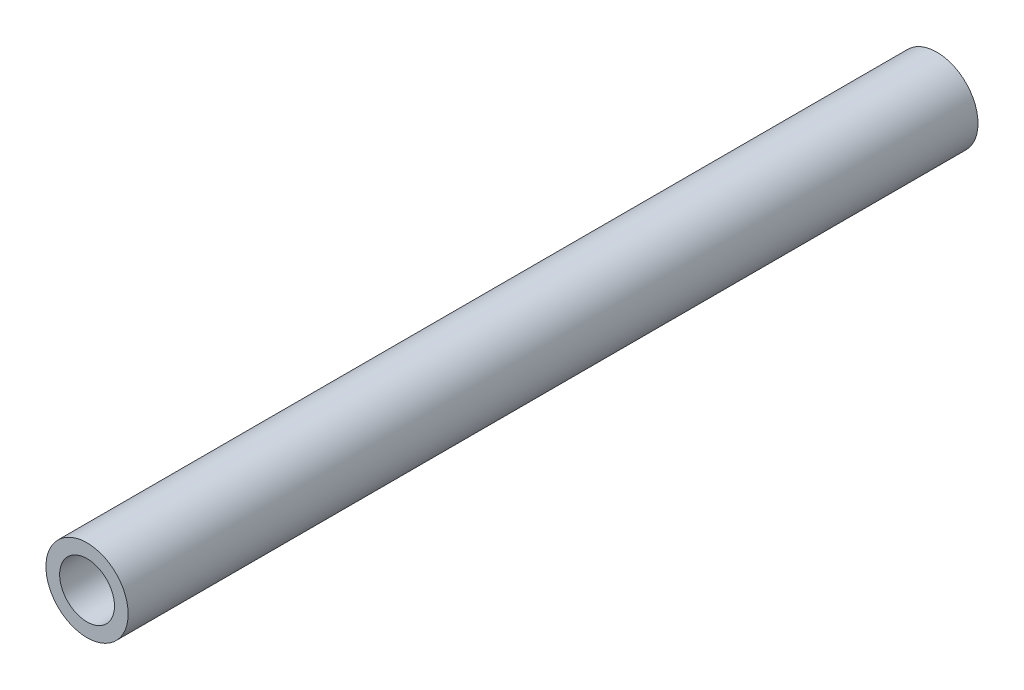
ISO-10303-21;
HEADER;
FILE_DESCRIPTION(('STEP AP214'),'2;1');
FILE_NAME('part.step','',(''),(''),'','','');
FILE_SCHEMA(('AUTOMOTIVE_DESIGN { 1 0 10303 214 1 1 1 1 }'));
ENDSEC;
DATA;
#1=APPLICATION_CONTEXT('core data for automotive mechanical design processes');
#2=APPLICATION_PROTOCOL_DEFINITION('international standard','automotive_design',2000,#1);
#3=PRODUCT_CONTEXT('',#1,'mechanical');
#4=PRODUCT('Part','Part','',(#3));
#5=PRODUCT_RELATED_PRODUCT_CATEGORY('part','',(#4));
#6=PRODUCT_DEFINITION_FORMATION('','',#4);
#7=PRODUCT_DEFINITION_CONTEXT('part definition',#1,'design');
#8=PRODUCT_DEFINITION('design','',#6,#7);
#9=PRODUCT_DEFINITION_SHAPE('','',#8);
#10=(LENGTH_UNIT() NAMED_UNIT(*) SI_UNIT(.MILLI.,.METRE.));
#11=(NAMED_UNIT(*) PLANE_ANGLE_UNIT() SI_UNIT($,.RADIAN.));
#12=(NAMED_UNIT(*) SI_UNIT($,.STERADIAN.) SOLID_ANGLE_UNIT());
#13=UNCERTAINTY_MEASURE_WITH_UNIT(LENGTH_MEASURE(1.E-05),#10,'distance_accuracy_value','');
#14=(GEOMETRIC_REPRESENTATION_CONTEXT(3) GLOBAL_UNCERTAINTY_ASSIGNED_CONTEXT((#13)) GLOBAL_UNIT_ASSIGNED_CONTEXT((#10,
#11,#12)) REPRESENTATION_CONTEXT('',''));
#15=CARTESIAN_POINT('',(0.,0.,0.));
#16=DIRECTION('',(0.,0.,1.));
#17=DIRECTION('',(1.,0.,0.));
#18=AXIS2_PLACEMENT_3D('',#15,#16,#17);
#19=CARTESIAN_POINT('',(0.,0.,62.));
#20=DIRECTION('',(0.,0.,1.));
#21=DIRECTION('',(1.,0.,0.));
#22=AXIS2_PLACEMENT_3D('',#19,#20,#21);
#23=PLANE('',#22);
#24=CARTESIAN_POINT('',(0.,0.,62.));
#25=DIRECTION('',(0.,0.,1.));
#26=DIRECTION('',(1.,0.,0.));
#27=AXIS2_PLACEMENT_3D('',#24,#25,#26);
#28=CIRCLE('',#27,3.);
#29=CARTESIAN_POINT('',(3.,0.,62.));
#30=VERTEX_POINT('',#29);
#31=EDGE_CURVE('E10',#30,#30,#28,.T.);
#32=ORIENTED_EDGE('',*,*,#31,.T.);
#33=EDGE_LOOP('',(#32));
#34=FACE_BOUND('',#33,.T.);
#35=CARTESIAN_POINT('',(0.,0.,62.));
#36=DIRECTION('',(0.,0.,1.));
#37=DIRECTION('',(1.,0.,0.));
#38=AXIS2_PLACEMENT_3D('',#35,#36,#37);
#39=CIRCLE('',#38,2.);
#40=CARTESIAN_POINT('',(2.,0.,62.));
#41=VERTEX_POINT('',#40);
#42=EDGE_CURVE('E44',#41,#41,#39,.T.);
#43=ORIENTED_EDGE('',*,*,#42,.F.);
#44=EDGE_LOOP('',(#43));
#45=FACE_BOUND('',#44,.T.);
#46=ADVANCED_FACE('F33',(#34,#45),#23,.T.);
#47=CARTESIAN_POINT('',(0.,0.,0.));
#48=DIRECTION('',(0.,0.,1.));
#49=DIRECTION('',(1.,0.,0.));
#50=AXIS2_PLACEMENT_3D('',#47,#48,#49);
#51=PLANE('',#50);
#52=CARTESIAN_POINT('',(0.,0.,0.));
#53=DIRECTION('',(0.,0.,1.));
#54=DIRECTION('',(1.,0.,0.));
#55=AXIS2_PLACEMENT_3D('',#52,#53,#54);
#56=CIRCLE('',#55,3.);
#57=CARTESIAN_POINT('',(3.,0.,0.));
#58=VERTEX_POINT('',#57);
#59=EDGE_CURVE('E37',#58,#58,#56,.T.);
#60=ORIENTED_EDGE('',*,*,#59,.F.);
#61=EDGE_LOOP('',(#60));
#62=FACE_BOUND('',#61,.T.);
#63=CARTESIAN_POINT('',(0.,0.,0.));
#64=DIRECTION('',(0.,0.,1.));
#65=DIRECTION('',(1.,0.,0.));
#66=AXIS2_PLACEMENT_3D('',#63,#64,#65);
#67=CIRCLE('',#66,2.);
#68=CARTESIAN_POINT('',(2.,0.,0.));
#69=VERTEX_POINT('',#68);
#70=EDGE_CURVE('E46',#69,#69,#67,.T.);
#71=ORIENTED_EDGE('',*,*,#70,.T.);
#72=EDGE_LOOP('',(#71));
#73=FACE_BOUND('',#72,.T.);
#74=ADVANCED_FACE('F56',(#62,#73),#51,.F.);
#75=CARTESIAN_POINT('',(0.,0.,62.));
#76=DIRECTION('',(0.,0.,-1.));
#77=DIRECTION('',(-1.,0.,0.));
#78=AXIS2_PLACEMENT_3D('',#75,#76,#77);
#79=CYLINDRICAL_SURFACE('',#78,3.);
#80=ORIENTED_EDGE('',*,*,#31,.F.);
#81=EDGE_LOOP('',(#80));
#82=FACE_BOUND('',#81,.T.);
#83=ORIENTED_EDGE('',*,*,#59,.T.);
#84=EDGE_LOOP('',(#83));
#85=FACE_BOUND('',#84,.T.);
#86=ADVANCED_FACE('F35',(#82,#85),#79,.T.);
#87=CARTESIAN_POINT('',(0.,0.,62.));
#88=DIRECTION('',(0.,0.,-1.));
#89=DIRECTION('',(-1.,0.,0.));
#90=AXIS2_PLACEMENT_3D('',#87,#88,#89);
#91=CYLINDRICAL_SURFACE('',#90,2.);
#92=ORIENTED_EDGE('',*,*,#42,.T.);
#93=EDGE_LOOP('',(#92));
#94=FACE_BOUND('',#93,.T.);
#95=ORIENTED_EDGE('',*,*,#70,.F.);
#96=EDGE_LOOP('',(#95));
#97=FACE_BOUND('',#96,.T.);
#98=ADVANCED_FACE('F52',(#94,#97),#91,.F.);
#99=CLOSED_SHELL('',(#46,#74,#86,#98));
#100=MANIFOLD_SOLID_BREP('B2',#99);
#101=ADVANCED_BREP_SHAPE_REPRESENTATION('',(#18,#100),#14);
#102=SHAPE_DEFINITION_REPRESENTATION(#9,#101);
ENDSEC;
END-ISO-10303-21;
